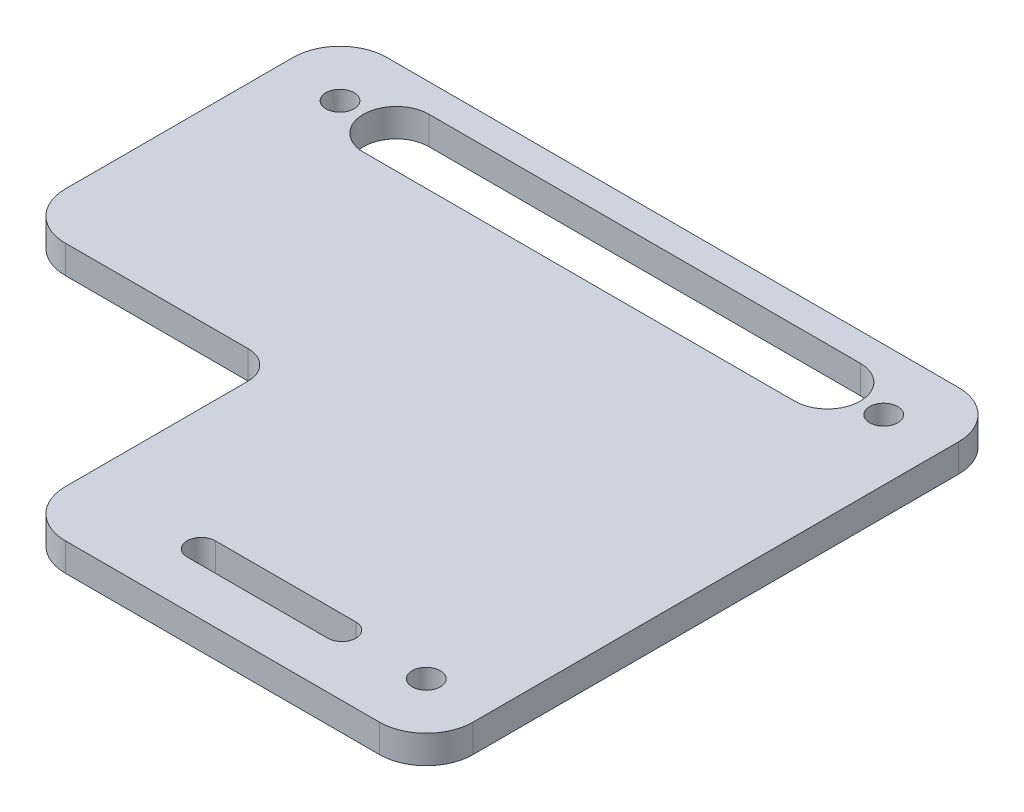
ISO-10303-21;
HEADER;
FILE_DESCRIPTION(('STEP AP214'),'2;1');
FILE_NAME('part.step','',(''),(''),'','','');
FILE_SCHEMA(('AUTOMOTIVE_DESIGN { 1 0 10303 214 1 1 1 1 }'));
ENDSEC;
DATA;
#1=APPLICATION_CONTEXT('core data for automotive mechanical design processes');
#2=APPLICATION_PROTOCOL_DEFINITION('international standard','automotive_design',2000,#1);
#3=PRODUCT_CONTEXT('',#1,'mechanical');
#4=PRODUCT('Part','Part','',(#3));
#5=PRODUCT_RELATED_PRODUCT_CATEGORY('part','',(#4));
#6=PRODUCT_DEFINITION_FORMATION('','',#4);
#7=PRODUCT_DEFINITION_CONTEXT('part definition',#1,'design');
#8=PRODUCT_DEFINITION('design','',#6,#7);
#9=PRODUCT_DEFINITION_SHAPE('','',#8);
#10=(LENGTH_UNIT() NAMED_UNIT(*) SI_UNIT(.MILLI.,.METRE.));
#11=(NAMED_UNIT(*) PLANE_ANGLE_UNIT() SI_UNIT($,.RADIAN.));
#12=(NAMED_UNIT(*) SI_UNIT($,.STERADIAN.) SOLID_ANGLE_UNIT());
#13=UNCERTAINTY_MEASURE_WITH_UNIT(LENGTH_MEASURE(1.E-05),#10,'distance_accuracy_value','');
#14=(GEOMETRIC_REPRESENTATION_CONTEXT(3) GLOBAL_UNCERTAINTY_ASSIGNED_CONTEXT((#13)) GLOBAL_UNIT_ASSIGNED_CONTEXT((#10,
#11,#12)) REPRESENTATION_CONTEXT('',''));
#15=CARTESIAN_POINT('',(0.,0.,0.));
#16=DIRECTION('',(0.,0.,1.));
#17=DIRECTION('',(1.,0.,0.));
#18=AXIS2_PLACEMENT_3D('',#15,#16,#17);
#19=CARTESIAN_POINT('',(-36.9074889867841,3.,40.0621145374449));
#20=DIRECTION('',(1.,0.,0.));
#21=DIRECTION('',(0.,0.,-1.));
#22=AXIS2_PLACEMENT_3D('',#19,#20,#21);
#23=PLANE('',#22);
#24=DIRECTION('',(0.,0.,1.));
#25=VECTOR('',#24,1.);
#26=CARTESIAN_POINT('',(-36.9074889867841,0.,40.0621145374449));
#27=LINE('',#26,#25);
#28=CARTESIAN_POINT('',(-36.9074889867841,0.,-16.7378854625551));
#29=VERTEX_POINT('',#28);
#30=CARTESIAN_POINT('',(-36.9074889867841,0.,7.56211453744492));
#31=VERTEX_POINT('',#30);
#32=EDGE_CURVE('E262',#29,#31,#27,.T.);
#33=ORIENTED_EDGE('',*,*,#32,.T.);
#34=DIRECTION('',(0.,-1.,0.));
#35=VECTOR('',#34,1.);
#36=CARTESIAN_POINT('',(-36.9074889867841,3.,7.56211453744492));
#37=LINE('',#36,#35);
#38=CARTESIAN_POINT('',(-36.9074889867841,3.,7.56211453744492));
#39=VERTEX_POINT('',#38);
#40=EDGE_CURVE('E323',#31,#39,#37,.F.);
#41=ORIENTED_EDGE('',*,*,#40,.T.);
#42=DIRECTION('',(0.,0.,1.));
#43=VECTOR('',#42,1.);
#44=CARTESIAN_POINT('',(-36.9074889867841,3.,40.0621145374449));
#45=LINE('',#44,#43);
#46=CARTESIAN_POINT('',(-36.9074889867841,3.,-16.7378854625551));
#47=VERTEX_POINT('',#46);
#48=EDGE_CURVE('E265',#47,#39,#45,.T.);
#49=ORIENTED_EDGE('',*,*,#48,.F.);
#50=DIRECTION('',(0.,-1.,0.));
#51=VECTOR('',#50,1.);
#52=CARTESIAN_POINT('',(-36.9074889867841,3.,-16.7378854625551));
#53=LINE('',#52,#51);
#54=EDGE_CURVE('E276',#47,#29,#53,.T.);
#55=ORIENTED_EDGE('',*,*,#54,.T.);
#56=EDGE_LOOP('',(#33,#41,#49,#55));
#57=FACE_BOUND('',#56,.T.);
#58=ADVANCED_FACE('F32',(#57),#23,.F.);
#59=CARTESIAN_POINT('',(34.0925110132159,3.,40.0621145374449));
#60=DIRECTION('',(0.,0.,-1.));
#61=DIRECTION('',(-1.,0.,0.));
#62=AXIS2_PLACEMENT_3D('',#59,#60,#61);
#63=PLANE('',#62);
#64=DIRECTION('',(1.,0.,0.));
#65=VECTOR('',#64,1.);
#66=CARTESIAN_POINT('',(34.0925110132159,3.,40.0621145374449));
#67=LINE('',#66,#65);
#68=CARTESIAN_POINT('',(-4.40748898678412,3.,40.0621145374449));
#69=VERTEX_POINT('',#68);
#70=CARTESIAN_POINT('',(29.0925110132159,3.,40.0621145374449));
#71=VERTEX_POINT('',#70);
#72=EDGE_CURVE('E268',#69,#71,#67,.T.);
#73=ORIENTED_EDGE('',*,*,#72,.F.);
#74=DIRECTION('',(0.,-1.,0.));
#75=VECTOR('',#74,1.);
#76=CARTESIAN_POINT('',(-4.40748898678412,3.,40.0621145374449));
#77=LINE('',#76,#75);
#78=CARTESIAN_POINT('',(-4.40748898678412,0.,40.0621145374449));
#79=VERTEX_POINT('',#78);
#80=EDGE_CURVE('E329',#69,#79,#77,.T.);
#81=ORIENTED_EDGE('',*,*,#80,.T.);
#82=DIRECTION('',(1.,0.,0.));
#83=VECTOR('',#82,1.);
#84=CARTESIAN_POINT('',(34.0925110132159,0.,40.0621145374449));
#85=LINE('',#84,#83);
#86=CARTESIAN_POINT('',(29.0925110132159,0.,40.0621145374449));
#87=VERTEX_POINT('',#86);
#88=EDGE_CURVE('E279',#79,#87,#85,.T.);
#89=ORIENTED_EDGE('',*,*,#88,.T.);
#90=DIRECTION('',(0.,-1.,0.));
#91=VECTOR('',#90,1.);
#92=CARTESIAN_POINT('',(29.0925110132159,3.,40.0621145374449));
#93=LINE('',#92,#91);
#94=EDGE_CURVE('E301',#87,#71,#93,.F.);
#95=ORIENTED_EDGE('',*,*,#94,.T.);
#96=EDGE_LOOP('',(#73,#81,#89,#95));
#97=FACE_BOUND('',#96,.T.);
#98=ADVANCED_FACE('F363',(#97),#63,.F.);
#99=CARTESIAN_POINT('',(34.0925110132159,3.,-21.7378854625551));
#100=DIRECTION('',(-1.,0.,0.));
#101=DIRECTION('',(0.,0.,1.));
#102=AXIS2_PLACEMENT_3D('',#99,#100,#101);
#103=PLANE('',#102);
#104=DIRECTION('',(0.,0.,-1.));
#105=VECTOR('',#104,1.);
#106=CARTESIAN_POINT('',(34.0925110132159,0.,-21.7378854625551));
#107=LINE('',#106,#105);
#108=CARTESIAN_POINT('',(34.0925110132159,0.,35.0621145374449));
#109=VERTEX_POINT('',#108);
#110=CARTESIAN_POINT('',(34.0925110132159,0.,-16.7378854625551));
#111=VERTEX_POINT('',#110);
#112=EDGE_CURVE('E281',#109,#111,#107,.T.);
#113=ORIENTED_EDGE('',*,*,#112,.T.);
#114=DIRECTION('',(0.,-1.,0.));
#115=VECTOR('',#114,1.);
#116=CARTESIAN_POINT('',(34.0925110132159,3.,-16.7378854625551));
#117=LINE('',#116,#115);
#118=CARTESIAN_POINT('',(34.0925110132159,3.,-16.7378854625551));
#119=VERTEX_POINT('',#118);
#120=EDGE_CURVE('E311',#111,#119,#117,.F.);
#121=ORIENTED_EDGE('',*,*,#120,.T.);
#122=DIRECTION('',(0.,0.,-1.));
#123=VECTOR('',#122,1.);
#124=CARTESIAN_POINT('',(34.0925110132159,3.,-21.7378854625551));
#125=LINE('',#124,#123);
#126=CARTESIAN_POINT('',(34.0925110132159,3.,35.0621145374449));
#127=VERTEX_POINT('',#126);
#128=EDGE_CURVE('E271',#127,#119,#125,.T.);
#129=ORIENTED_EDGE('',*,*,#128,.F.);
#130=DIRECTION('',(0.,-1.,0.));
#131=VECTOR('',#130,1.);
#132=CARTESIAN_POINT('',(34.0925110132159,3.,35.0621145374449));
#133=LINE('',#132,#131);
#134=EDGE_CURVE('E295',#127,#109,#133,.T.);
#135=ORIENTED_EDGE('',*,*,#134,.T.);
#136=EDGE_LOOP('',(#113,#121,#129,#135));
#137=FACE_BOUND('',#136,.T.);
#138=ADVANCED_FACE('F373',(#137),#103,.F.);
#139=CARTESIAN_POINT('',(-36.9074889867841,3.,-21.7378854625551));
#140=DIRECTION('',(0.,0.,1.));
#141=DIRECTION('',(1.,0.,0.));
#142=AXIS2_PLACEMENT_3D('',#139,#140,#141);
#143=PLANE('',#142);
#144=DIRECTION('',(-1.,0.,0.));
#145=VECTOR('',#144,1.);
#146=CARTESIAN_POINT('',(-36.9074889867841,3.,-21.7378854625551));
#147=LINE('',#146,#145);
#148=CARTESIAN_POINT('',(29.0925110132159,3.,-21.7378854625551));
#149=VERTEX_POINT('',#148);
#150=CARTESIAN_POINT('',(-31.9074889867841,3.,-21.7378854625551));
#151=VERTEX_POINT('',#150);
#152=EDGE_CURVE('E274',#149,#151,#147,.T.);
#153=ORIENTED_EDGE('',*,*,#152,.F.);
#154=DIRECTION('',(0.,-1.,0.));
#155=VECTOR('',#154,1.);
#156=CARTESIAN_POINT('',(29.0925110132159,3.,-21.7378854625551));
#157=LINE('',#156,#155);
#158=CARTESIAN_POINT('',(29.0925110132159,0.,-21.7378854625551));
#159=VERTEX_POINT('',#158);
#160=EDGE_CURVE('E306',#149,#159,#157,.T.);
#161=ORIENTED_EDGE('',*,*,#160,.T.);
#162=DIRECTION('',(-1.,0.,0.));
#163=VECTOR('',#162,1.);
#164=CARTESIAN_POINT('',(-36.9074889867841,0.,-21.7378854625551));
#165=LINE('',#164,#163);
#166=CARTESIAN_POINT('',(-31.9074889867841,0.,-21.7378854625551));
#167=VERTEX_POINT('',#166);
#168=EDGE_CURVE('E269',#159,#167,#165,.T.);
#169=ORIENTED_EDGE('',*,*,#168,.T.);
#170=DIRECTION('',(0.,-1.,0.));
#171=VECTOR('',#170,1.);
#172=CARTESIAN_POINT('',(-31.9074889867841,3.,-21.7378854625551));
#173=LINE('',#172,#171);
#174=EDGE_CURVE('E290',#167,#151,#173,.F.);
#175=ORIENTED_EDGE('',*,*,#174,.T.);
#176=EDGE_LOOP('',(#153,#161,#169,#175));
#177=FACE_BOUND('',#176,.T.);
#178=ADVANCED_FACE('F381',(#177),#143,.F.);
#179=CARTESIAN_POINT('',(0.,3.,0.));
#180=DIRECTION('',(0.,-1.,0.));
#181=DIRECTION('',(0.,0.,-1.));
#182=AXIS2_PLACEMENT_3D('',#179,#180,#181);
#183=PLANE('',#182);
#184=DIRECTION('',(-1.,0.,0.));
#185=VECTOR('',#184,1.);
#186=CARTESIAN_POINT('',(3.59251101321588,3.,35.0621145374449));
#187=LINE('',#186,#185);
#188=CARTESIAN_POINT('',(18.5925110132159,3.,35.0621145374449));
#189=VERTEX_POINT('',#188);
#190=CARTESIAN_POINT('',(3.59251101321588,3.,35.0621145374449));
#191=VERTEX_POINT('',#190);
#192=EDGE_CURVE('E176',#189,#191,#187,.T.);
#193=ORIENTED_EDGE('',*,*,#192,.T.);
#194=CARTESIAN_POINT('',(3.59251101321588,3.,33.5621145374449));
#195=DIRECTION('',(0.,-1.,0.));
#196=DIRECTION('',(0.,0.,-1.));
#197=AXIS2_PLACEMENT_3D('',#194,#195,#196);
#198=CIRCLE('',#197,1.49999999999999);
#199=CARTESIAN_POINT('',(3.59251101321588,3.,32.0621145374449));
#200=VERTEX_POINT('',#199);
#201=EDGE_CURVE('E170',#191,#200,#198,.T.);
#202=ORIENTED_EDGE('',*,*,#201,.T.);
#203=DIRECTION('',(1.,0.,0.));
#204=VECTOR('',#203,1.);
#205=CARTESIAN_POINT('',(3.59251101321588,3.,32.0621145374449));
#206=LINE('',#205,#204);
#207=CARTESIAN_POINT('',(18.5925110132159,3.,32.0621145374449));
#208=VERTEX_POINT('',#207);
#209=EDGE_CURVE('E179',#200,#208,#206,.T.);
#210=ORIENTED_EDGE('',*,*,#209,.T.);
#211=CARTESIAN_POINT('',(18.5925110132159,3.,33.5621145374449));
#212=DIRECTION('',(0.,-1.,0.));
#213=DIRECTION('',(0.,0.,-1.));
#214=AXIS2_PLACEMENT_3D('',#211,#212,#213);
#215=CIRCLE('',#214,1.49999999999999);
#216=EDGE_CURVE('E47',#208,#189,#215,.T.);
#217=ORIENTED_EDGE('',*,*,#216,.T.);
#218=EDGE_LOOP('',(#193,#202,#210,#217));
#219=FACE_BOUND('',#218,.T.);
#220=DIRECTION('',(-1.,0.,0.));
#221=VECTOR('',#220,1.);
#222=CARTESIAN_POINT('',(-24.4074889867841,3.,-11.7378854625551));
#223=LINE('',#222,#221);
#224=CARTESIAN_POINT('',(21.5925110132159,3.,-11.7378854625551));
#225=VERTEX_POINT('',#224);
#226=CARTESIAN_POINT('',(-24.4074889867841,3.,-11.7378854625551));
#227=VERTEX_POINT('',#226);
#228=EDGE_CURVE('E225',#225,#227,#223,.T.);
#229=ORIENTED_EDGE('',*,*,#228,.T.);
#230=CARTESIAN_POINT('',(-24.4074889867841,3.,-15.2378854625551));
#231=DIRECTION('',(0.,-1.,0.));
#232=DIRECTION('',(0.,0.,-1.));
#233=AXIS2_PLACEMENT_3D('',#230,#231,#232);
#234=CIRCLE('',#233,3.49999999999998);
#235=CARTESIAN_POINT('',(-24.4074889867841,3.,-18.7378854625551));
#236=VERTEX_POINT('',#235);
#237=EDGE_CURVE('E215',#227,#236,#234,.T.);
#238=ORIENTED_EDGE('',*,*,#237,.T.);
#239=DIRECTION('',(1.,0.,0.));
#240=VECTOR('',#239,1.);
#241=CARTESIAN_POINT('',(-24.4074889867841,3.,-18.7378854625551));
#242=LINE('',#241,#240);
#243=CARTESIAN_POINT('',(21.5925110132159,3.,-18.737885462555));
#244=VERTEX_POINT('',#243);
#245=EDGE_CURVE('E218',#236,#244,#242,.T.);
#246=ORIENTED_EDGE('',*,*,#245,.T.);
#247=CARTESIAN_POINT('',(21.5925110132159,3.,-15.2378854625551));
#248=DIRECTION('',(0.,-1.,0.));
#249=DIRECTION('',(0.,0.,-1.));
#250=AXIS2_PLACEMENT_3D('',#247,#248,#249);
#251=CIRCLE('',#250,3.49999999999998);
#252=EDGE_CURVE('E222',#244,#225,#251,.T.);
#253=ORIENTED_EDGE('',*,*,#252,.T.);
#254=EDGE_LOOP('',(#229,#238,#246,#253));
#255=FACE_BOUND('',#254,.T.);
#256=CARTESIAN_POINT('',(27.5925110132159,3.,-15.2378854625551));
#257=DIRECTION('',(0.,-1.,0.));
#258=DIRECTION('',(0.,0.,-1.));
#259=AXIS2_PLACEMENT_3D('',#256,#257,#258);
#260=CIRCLE('',#259,1.5);
#261=CARTESIAN_POINT('',(27.5925110132159,3.,-16.7378854625551));
#262=VERTEX_POINT('',#261);
#263=EDGE_CURVE('E247',#262,#262,#260,.T.);
#264=ORIENTED_EDGE('',*,*,#263,.T.);
#265=EDGE_LOOP('',(#264));
#266=FACE_BOUND('',#265,.T.);
#267=CARTESIAN_POINT('',(27.5925110132159,3.,33.5621145374449));
#268=DIRECTION('',(0.,-1.,0.));
#269=DIRECTION('',(0.,0.,-1.));
#270=AXIS2_PLACEMENT_3D('',#267,#268,#269);
#271=CIRCLE('',#270,1.5);
#272=CARTESIAN_POINT('',(27.5925110132159,3.,32.0621145374449));
#273=VERTEX_POINT('',#272);
#274=EDGE_CURVE('E253',#273,#273,#271,.T.);
#275=ORIENTED_EDGE('',*,*,#274,.T.);
#276=EDGE_LOOP('',(#275));
#277=FACE_BOUND('',#276,.T.);
#278=CARTESIAN_POINT('',(-30.4074889867841,3.,-15.2378854625551));
#279=DIRECTION('',(0.,-1.,0.));
#280=DIRECTION('',(0.,0.,-1.));
#281=AXIS2_PLACEMENT_3D('',#278,#279,#280);
#282=CIRCLE('',#281,1.5);
#283=CARTESIAN_POINT('',(-30.4074889867841,3.,-16.7378854625551));
#284=VERTEX_POINT('',#283);
#285=EDGE_CURVE('E259',#284,#284,#282,.T.);
#286=ORIENTED_EDGE('',*,*,#285,.T.);
#287=EDGE_LOOP('',(#286));
#288=FACE_BOUND('',#287,.T.);
#289=ORIENTED_EDGE('',*,*,#48,.T.);
#290=CARTESIAN_POINT('',(-31.9074889867841,3.,7.56211453744492));
#291=DIRECTION('',(0.,-1.,0.));
#292=DIRECTION('',(0.,0.,-1.));
#293=AXIS2_PLACEMENT_3D('',#290,#291,#292);
#294=CIRCLE('',#293,5.);
#295=CARTESIAN_POINT('',(-31.9074889867841,3.,12.5621145374449));
#296=VERTEX_POINT('',#295);
#297=EDGE_CURVE('E327',#39,#296,#294,.F.);
#298=ORIENTED_EDGE('',*,*,#297,.T.);
#299=DIRECTION('',(1.,0.,0.));
#300=VECTOR('',#299,1.);
#301=CARTESIAN_POINT('',(-9.40748898678412,3.,12.5621145374449));
#302=LINE('',#301,#300);
#303=CARTESIAN_POINT('',(-12.4074889867841,3.,12.5621145374449));
#304=VERTEX_POINT('',#303);
#305=EDGE_CURVE('E205',#296,#304,#302,.T.);
#306=ORIENTED_EDGE('',*,*,#305,.T.);
#307=CARTESIAN_POINT('',(-12.4074889867841,3.,15.5621145374449));
#308=DIRECTION('',(0.,-1.,0.));
#309=DIRECTION('',(0.,0.,-1.));
#310=AXIS2_PLACEMENT_3D('',#307,#308,#309);
#311=CIRCLE('',#310,3.);
#312=CARTESIAN_POINT('',(-9.40748898678412,3.,15.5621145374449));
#313=VERTEX_POINT('',#312);
#314=EDGE_CURVE('E11',#304,#313,#311,.T.);
#315=ORIENTED_EDGE('',*,*,#314,.T.);
#316=DIRECTION('',(0.,0.,1.));
#317=VECTOR('',#316,1.);
#318=CARTESIAN_POINT('',(-9.40748898678412,3.,40.0621145374449));
#319=LINE('',#318,#317);
#320=CARTESIAN_POINT('',(-9.40748898678412,3.,35.0621145374449));
#321=VERTEX_POINT('',#320);
#322=EDGE_CURVE('E208',#313,#321,#319,.T.);
#323=ORIENTED_EDGE('',*,*,#322,.T.);
#324=CARTESIAN_POINT('',(-4.40748898678412,3.,35.0621145374449));
#325=DIRECTION('',(0.,-1.,0.));
#326=DIRECTION('',(0.,0.,-1.));
#327=AXIS2_PLACEMENT_3D('',#324,#325,#326);
#328=CIRCLE('',#327,5.);
#329=EDGE_CURVE('E325',#321,#69,#328,.F.);
#330=ORIENTED_EDGE('',*,*,#329,.T.);
#331=ORIENTED_EDGE('',*,*,#72,.T.);
#332=CARTESIAN_POINT('',(29.0925110132159,3.,35.0621145374449));
#333=DIRECTION('',(0.,-1.,0.));
#334=DIRECTION('',(0.,0.,-1.));
#335=AXIS2_PLACEMENT_3D('',#332,#333,#334);
#336=CIRCLE('',#335,5.);
#337=EDGE_CURVE('E304',#71,#127,#336,.F.);
#338=ORIENTED_EDGE('',*,*,#337,.T.);
#339=ORIENTED_EDGE('',*,*,#128,.T.);
#340=CARTESIAN_POINT('',(29.0925110132159,3.,-16.7378854625551));
#341=DIRECTION('',(0.,-1.,0.));
#342=DIRECTION('',(0.,0.,-1.));
#343=AXIS2_PLACEMENT_3D('',#340,#341,#342);
#344=CIRCLE('',#343,5.);
#345=EDGE_CURVE('E313',#119,#149,#344,.F.);
#346=ORIENTED_EDGE('',*,*,#345,.T.);
#347=ORIENTED_EDGE('',*,*,#152,.T.);
#348=CARTESIAN_POINT('',(-31.9074889867841,3.,-16.7378854625551));
#349=DIRECTION('',(0.,-1.,0.));
#350=DIRECTION('',(0.,0.,-1.));
#351=AXIS2_PLACEMENT_3D('',#348,#349,#350);
#352=CIRCLE('',#351,5.);
#353=EDGE_CURVE('E293',#151,#47,#352,.F.);
#354=ORIENTED_EDGE('',*,*,#353,.T.);
#355=EDGE_LOOP('',(#289,#298,#306,#315,#323,#330,#331,#338,#339,#346,#347,#354));
#356=FACE_BOUND('',#355,.T.);
#357=ADVANCED_FACE('F183',(#219,#255,#266,#277,#288,#356),#183,.F.);
#358=CARTESIAN_POINT('',(0.,0.,0.));
#359=DIRECTION('',(0.,-1.,0.));
#360=DIRECTION('',(0.,0.,-1.));
#361=AXIS2_PLACEMENT_3D('',#358,#359,#360);
#362=PLANE('',#361);
#363=CARTESIAN_POINT('',(3.59251101321588,0.,33.5621145374449));
#364=DIRECTION('',(0.,-1.,0.));
#365=DIRECTION('',(0.,0.,-1.));
#366=AXIS2_PLACEMENT_3D('',#363,#364,#365);
#367=CIRCLE('',#366,1.49999999999999);
#368=CARTESIAN_POINT('',(3.59251101321588,0.,35.0621145374449));
#369=VERTEX_POINT('',#368);
#370=CARTESIAN_POINT('',(3.59251101321588,0.,32.0621145374449));
#371=VERTEX_POINT('',#370);
#372=EDGE_CURVE('E55',#369,#371,#367,.T.);
#373=ORIENTED_EDGE('',*,*,#372,.F.);
#374=DIRECTION('',(-1.,0.,0.));
#375=VECTOR('',#374,1.);
#376=CARTESIAN_POINT('',(3.59251101321588,0.,35.0621145374449));
#377=LINE('',#376,#375);
#378=CARTESIAN_POINT('',(18.5925110132159,0.,35.0621145374449));
#379=VERTEX_POINT('',#378);
#380=EDGE_CURVE('E186',#379,#369,#377,.T.);
#381=ORIENTED_EDGE('',*,*,#380,.F.);
#382=CARTESIAN_POINT('',(18.5925110132159,0.,33.5621145374449));
#383=DIRECTION('',(0.,-1.,0.));
#384=DIRECTION('',(0.,0.,-1.));
#385=AXIS2_PLACEMENT_3D('',#382,#383,#384);
#386=CIRCLE('',#385,1.49999999999999);
#387=CARTESIAN_POINT('',(18.5925110132159,0.,32.0621145374449));
#388=VERTEX_POINT('',#387);
#389=EDGE_CURVE('E189',#388,#379,#386,.T.);
#390=ORIENTED_EDGE('',*,*,#389,.F.);
#391=DIRECTION('',(1.,0.,0.));
#392=VECTOR('',#391,1.);
#393=CARTESIAN_POINT('',(3.59251101321588,0.,32.0621145374449));
#394=LINE('',#393,#392);
#395=EDGE_CURVE('E195',#371,#388,#394,.T.);
#396=ORIENTED_EDGE('',*,*,#395,.F.);
#397=EDGE_LOOP('',(#373,#381,#390,#396));
#398=FACE_BOUND('',#397,.T.);
#399=DIRECTION('',(1.,0.,0.));
#400=VECTOR('',#399,1.);
#401=CARTESIAN_POINT('',(-9.40748898678412,0.,12.5621145374449));
#402=LINE('',#401,#400);
#403=CARTESIAN_POINT('',(-31.9074889867841,0.,12.5621145374449));
#404=VERTEX_POINT('',#403);
#405=CARTESIAN_POINT('',(-12.4074889867841,0.,12.5621145374449));
#406=VERTEX_POINT('',#405);
#407=EDGE_CURVE('E201',#404,#406,#402,.T.);
#408=ORIENTED_EDGE('',*,*,#407,.F.);
#409=CARTESIAN_POINT('',(-31.9074889867841,0.,7.56211453744492));
#410=DIRECTION('',(0.,-1.,0.));
#411=DIRECTION('',(0.,0.,-1.));
#412=AXIS2_PLACEMENT_3D('',#409,#410,#411);
#413=CIRCLE('',#412,5.);
#414=EDGE_CURVE('E321',#404,#31,#413,.T.);
#415=ORIENTED_EDGE('',*,*,#414,.T.);
#416=ORIENTED_EDGE('',*,*,#32,.F.);
#417=CARTESIAN_POINT('',(-31.9074889867841,0.,-16.7378854625551));
#418=DIRECTION('',(0.,-1.,0.));
#419=DIRECTION('',(0.,0.,-1.));
#420=AXIS2_PLACEMENT_3D('',#417,#418,#419);
#421=CIRCLE('',#420,5.);
#422=EDGE_CURVE('E287',#29,#167,#421,.T.);
#423=ORIENTED_EDGE('',*,*,#422,.T.);
#424=ORIENTED_EDGE('',*,*,#168,.F.);
#425=CARTESIAN_POINT('',(29.0925110132159,0.,-16.7378854625551));
#426=DIRECTION('',(0.,-1.,0.));
#427=DIRECTION('',(0.,0.,-1.));
#428=AXIS2_PLACEMENT_3D('',#425,#426,#427);
#429=CIRCLE('',#428,5.);
#430=EDGE_CURVE('E309',#159,#111,#429,.T.);
#431=ORIENTED_EDGE('',*,*,#430,.T.);
#432=ORIENTED_EDGE('',*,*,#112,.F.);
#433=CARTESIAN_POINT('',(29.0925110132159,0.,35.0621145374449));
#434=DIRECTION('',(0.,-1.,0.));
#435=DIRECTION('',(0.,0.,-1.));
#436=AXIS2_PLACEMENT_3D('',#433,#434,#435);
#437=CIRCLE('',#436,5.);
#438=EDGE_CURVE('E298',#109,#87,#437,.T.);
#439=ORIENTED_EDGE('',*,*,#438,.T.);
#440=ORIENTED_EDGE('',*,*,#88,.F.);
#441=CARTESIAN_POINT('',(-4.40748898678412,0.,35.0621145374449));
#442=DIRECTION('',(0.,-1.,0.));
#443=DIRECTION('',(0.,0.,-1.));
#444=AXIS2_PLACEMENT_3D('',#441,#442,#443);
#445=CIRCLE('',#444,5.);
#446=CARTESIAN_POINT('',(-9.40748898678412,0.,35.0621145374449));
#447=VERTEX_POINT('',#446);
#448=EDGE_CURVE('E318',#79,#447,#445,.T.);
#449=ORIENTED_EDGE('',*,*,#448,.T.);
#450=DIRECTION('',(0.,0.,1.));
#451=VECTOR('',#450,1.);
#452=CARTESIAN_POINT('',(-9.40748898678412,0.,40.0621145374449));
#453=LINE('',#452,#451);
#454=CARTESIAN_POINT('',(-9.40748898678412,0.,15.5621145374449));
#455=VERTEX_POINT('',#454);
#456=EDGE_CURVE('E209',#455,#447,#453,.T.);
#457=ORIENTED_EDGE('',*,*,#456,.F.);
#458=CARTESIAN_POINT('',(-12.4074889867841,0.,15.5621145374449));
#459=DIRECTION('',(0.,-1.,0.));
#460=DIRECTION('',(0.,0.,-1.));
#461=AXIS2_PLACEMENT_3D('',#458,#459,#460);
#462=CIRCLE('',#461,3.);
#463=EDGE_CURVE('E40',#455,#406,#462,.F.);
#464=ORIENTED_EDGE('',*,*,#463,.T.);
#465=EDGE_LOOP('',(#408,#415,#416,#423,#424,#431,#432,#439,#440,#449,#457,#464));
#466=FACE_BOUND('',#465,.T.);
#467=CARTESIAN_POINT('',(-24.4074889867841,0.,-15.2378854625551));
#468=DIRECTION('',(0.,-1.,0.));
#469=DIRECTION('',(0.,0.,-1.));
#470=AXIS2_PLACEMENT_3D('',#467,#468,#469);
#471=CIRCLE('',#470,3.49999999999998);
#472=CARTESIAN_POINT('',(-24.4074889867841,0.,-11.7378854625551));
#473=VERTEX_POINT('',#472);
#474=CARTESIAN_POINT('',(-24.4074889867841,0.,-18.7378854625551));
#475=VERTEX_POINT('',#474);
#476=EDGE_CURVE('E211',#473,#475,#471,.T.);
#477=ORIENTED_EDGE('',*,*,#476,.F.);
#478=DIRECTION('',(-1.,0.,0.));
#479=VECTOR('',#478,1.);
#480=CARTESIAN_POINT('',(-24.4074889867841,0.,-11.7378854625551));
#481=LINE('',#480,#479);
#482=CARTESIAN_POINT('',(21.5925110132159,0.,-11.7378854625551));
#483=VERTEX_POINT('',#482);
#484=EDGE_CURVE('E219',#483,#473,#481,.T.);
#485=ORIENTED_EDGE('',*,*,#484,.F.);
#486=CARTESIAN_POINT('',(21.5925110132159,0.,-15.2378854625551));
#487=DIRECTION('',(0.,-1.,0.));
#488=DIRECTION('',(0.,0.,-1.));
#489=AXIS2_PLACEMENT_3D('',#486,#487,#488);
#490=CIRCLE('',#489,3.49999999999998);
#491=CARTESIAN_POINT('',(21.5925110132159,0.,-18.7378854625551));
#492=VERTEX_POINT('',#491);
#493=EDGE_CURVE('E233',#492,#483,#490,.T.);
#494=ORIENTED_EDGE('',*,*,#493,.F.);
#495=DIRECTION('',(1.,0.,0.));
#496=VECTOR('',#495,1.);
#497=CARTESIAN_POINT('',(-24.4074889867841,0.,-18.7378854625551));
#498=LINE('',#497,#496);
#499=EDGE_CURVE('E230',#475,#492,#498,.T.);
#500=ORIENTED_EDGE('',*,*,#499,.F.);
#501=EDGE_LOOP('',(#477,#485,#494,#500));
#502=FACE_BOUND('',#501,.T.);
#503=CARTESIAN_POINT('',(27.5925110132159,0.,-15.2378854625551));
#504=DIRECTION('',(0.,-1.,0.));
#505=DIRECTION('',(0.,0.,-1.));
#506=AXIS2_PLACEMENT_3D('',#503,#504,#505);
#507=CIRCLE('',#506,1.5);
#508=CARTESIAN_POINT('',(27.5925110132159,0.,-16.7378854625551));
#509=VERTEX_POINT('',#508);
#510=EDGE_CURVE('E240',#509,#509,#507,.T.);
#511=ORIENTED_EDGE('',*,*,#510,.F.);
#512=EDGE_LOOP('',(#511));
#513=FACE_BOUND('',#512,.T.);
#514=CARTESIAN_POINT('',(27.5925110132159,0.,33.5621145374449));
#515=DIRECTION('',(0.,-1.,0.));
#516=DIRECTION('',(0.,0.,-1.));
#517=AXIS2_PLACEMENT_3D('',#514,#515,#516);
#518=CIRCLE('',#517,1.5);
#519=CARTESIAN_POINT('',(27.5925110132159,0.,32.0621145374449));
#520=VERTEX_POINT('',#519);
#521=EDGE_CURVE('E250',#520,#520,#518,.T.);
#522=ORIENTED_EDGE('',*,*,#521,.F.);
#523=EDGE_LOOP('',(#522));
#524=FACE_BOUND('',#523,.T.);
#525=CARTESIAN_POINT('',(-30.4074889867841,0.,-15.2378854625551));
#526=DIRECTION('',(0.,-1.,0.));
#527=DIRECTION('',(0.,0.,-1.));
#528=AXIS2_PLACEMENT_3D('',#525,#526,#527);
#529=CIRCLE('',#528,1.5);
#530=CARTESIAN_POINT('',(-30.4074889867841,0.,-16.7378854625551));
#531=VERTEX_POINT('',#530);
#532=EDGE_CURVE('E256',#531,#531,#529,.T.);
#533=ORIENTED_EDGE('',*,*,#532,.F.);
#534=EDGE_LOOP('',(#533));
#535=FACE_BOUND('',#534,.T.);
#536=ADVANCED_FACE('F342',(#398,#466,#502,#513,#524,#535),#362,.T.);
#537=CARTESIAN_POINT('',(-31.9074889867841,3.,-16.7378854625551));
#538=DIRECTION('',(0.,-1.,0.));
#539=DIRECTION('',(0.,0.,-1.));
#540=AXIS2_PLACEMENT_3D('',#537,#538,#539);
#541=CYLINDRICAL_SURFACE('',#540,5.);
#542=ORIENTED_EDGE('',*,*,#353,.F.);
#543=ORIENTED_EDGE('',*,*,#174,.F.);
#544=ORIENTED_EDGE('',*,*,#422,.F.);
#545=ORIENTED_EDGE('',*,*,#54,.F.);
#546=EDGE_LOOP('',(#542,#543,#544,#545));
#547=FACE_BOUND('',#546,.T.);
#548=ADVANCED_FACE('F387',(#547),#541,.T.);
#549=CARTESIAN_POINT('',(29.0925110132159,3.,35.0621145374449));
#550=DIRECTION('',(0.,-1.,0.));
#551=DIRECTION('',(0.,0.,-1.));
#552=AXIS2_PLACEMENT_3D('',#549,#550,#551);
#553=CYLINDRICAL_SURFACE('',#552,5.);
#554=ORIENTED_EDGE('',*,*,#337,.F.);
#555=ORIENTED_EDGE('',*,*,#94,.F.);
#556=ORIENTED_EDGE('',*,*,#438,.F.);
#557=ORIENTED_EDGE('',*,*,#134,.F.);
#558=EDGE_LOOP('',(#554,#555,#556,#557));
#559=FACE_BOUND('',#558,.T.);
#560=ADVANCED_FACE('F369',(#559),#553,.T.);
#561=CARTESIAN_POINT('',(29.0925110132159,3.,-16.7378854625551));
#562=DIRECTION('',(0.,-1.,0.));
#563=DIRECTION('',(0.,0.,-1.));
#564=AXIS2_PLACEMENT_3D('',#561,#562,#563);
#565=CYLINDRICAL_SURFACE('',#564,5.);
#566=ORIENTED_EDGE('',*,*,#345,.F.);
#567=ORIENTED_EDGE('',*,*,#120,.F.);
#568=ORIENTED_EDGE('',*,*,#430,.F.);
#569=ORIENTED_EDGE('',*,*,#160,.F.);
#570=EDGE_LOOP('',(#566,#567,#568,#569));
#571=FACE_BOUND('',#570,.T.);
#572=ADVANCED_FACE('F377',(#571),#565,.T.);
#573=CARTESIAN_POINT('',(-30.4074889867841,3.,-15.2378854625551));
#574=DIRECTION('',(0.,-1.,0.));
#575=DIRECTION('',(0.,0.,-1.));
#576=AXIS2_PLACEMENT_3D('',#573,#574,#575);
#577=CYLINDRICAL_SURFACE('',#576,1.5);
#578=ORIENTED_EDGE('',*,*,#285,.F.);
#579=EDGE_LOOP('',(#578));
#580=FACE_BOUND('',#579,.T.);
#581=ORIENTED_EDGE('',*,*,#532,.T.);
#582=EDGE_LOOP('',(#581));
#583=FACE_BOUND('',#582,.T.);
#584=ADVANCED_FACE('F415',(#580,#583),#577,.F.);
#585=CARTESIAN_POINT('',(27.5925110132159,3.,33.5621145374449));
#586=DIRECTION('',(0.,-1.,0.));
#587=DIRECTION('',(0.,0.,-1.));
#588=AXIS2_PLACEMENT_3D('',#585,#586,#587);
#589=CYLINDRICAL_SURFACE('',#588,1.5);
#590=ORIENTED_EDGE('',*,*,#274,.F.);
#591=EDGE_LOOP('',(#590));
#592=FACE_BOUND('',#591,.T.);
#593=ORIENTED_EDGE('',*,*,#521,.T.);
#594=EDGE_LOOP('',(#593));
#595=FACE_BOUND('',#594,.T.);
#596=ADVANCED_FACE('F419',(#592,#595),#589,.F.);
#597=CARTESIAN_POINT('',(27.5925110132159,3.,-15.2378854625551));
#598=DIRECTION('',(0.,-1.,0.));
#599=DIRECTION('',(0.,0.,-1.));
#600=AXIS2_PLACEMENT_3D('',#597,#598,#599);
#601=CYLINDRICAL_SURFACE('',#600,1.5);
#602=ORIENTED_EDGE('',*,*,#263,.F.);
#603=EDGE_LOOP('',(#602));
#604=FACE_BOUND('',#603,.T.);
#605=ORIENTED_EDGE('',*,*,#510,.T.);
#606=EDGE_LOOP('',(#605));
#607=FACE_BOUND('',#606,.T.);
#608=ADVANCED_FACE('F425',(#604,#607),#601,.F.);
#609=CARTESIAN_POINT('',(-24.4074889867841,3.,-15.2378854625551));
#610=DIRECTION('',(0.,-1.,0.));
#611=DIRECTION('',(0.,0.,-1.));
#612=AXIS2_PLACEMENT_3D('',#609,#610,#611);
#613=CYLINDRICAL_SURFACE('',#612,3.49999999999998);
#614=ORIENTED_EDGE('',*,*,#476,.T.);
#615=DIRECTION('',(0.,-1.,0.));
#616=VECTOR('',#615,1.);
#617=CARTESIAN_POINT('',(-24.4074889867841,3.,-18.7378854625551));
#618=LINE('',#617,#616);
#619=EDGE_CURVE('E228',#236,#475,#618,.T.);
#620=ORIENTED_EDGE('',*,*,#619,.F.);
#621=ORIENTED_EDGE('',*,*,#237,.F.);
#622=DIRECTION('',(0.,-1.,0.));
#623=VECTOR('',#622,1.);
#624=CARTESIAN_POINT('',(-24.4074889867841,3.,-11.7378854625551));
#625=LINE('',#624,#623);
#626=EDGE_CURVE('E238',#227,#473,#625,.T.);
#627=ORIENTED_EDGE('',*,*,#626,.T.);
#628=EDGE_LOOP('',(#614,#620,#621,#627));
#629=FACE_BOUND('',#628,.T.);
#630=ADVANCED_FACE('F490',(#629),#613,.F.);
#631=CARTESIAN_POINT('',(-24.4074889867841,3.,-11.7378854625551));
#632=DIRECTION('',(0.,0.,1.));
#633=DIRECTION('',(1.,0.,0.));
#634=AXIS2_PLACEMENT_3D('',#631,#632,#633);
#635=PLANE('',#634);
#636=ORIENTED_EDGE('',*,*,#484,.T.);
#637=ORIENTED_EDGE('',*,*,#626,.F.);
#638=ORIENTED_EDGE('',*,*,#228,.F.);
#639=DIRECTION('',(0.,-1.,0.));
#640=VECTOR('',#639,1.);
#641=CARTESIAN_POINT('',(21.5925110132159,3.,-11.7378854625551));
#642=LINE('',#641,#640);
#643=EDGE_CURVE('E241',#225,#483,#642,.T.);
#644=ORIENTED_EDGE('',*,*,#643,.T.);
#645=EDGE_LOOP('',(#636,#637,#638,#644));
#646=FACE_BOUND('',#645,.T.);
#647=ADVANCED_FACE('F498',(#646),#635,.F.);
#648=CARTESIAN_POINT('',(21.5925110132159,3.,-15.2378854625551));
#649=DIRECTION('',(0.,-1.,0.));
#650=DIRECTION('',(0.,0.,-1.));
#651=AXIS2_PLACEMENT_3D('',#648,#649,#650);
#652=CYLINDRICAL_SURFACE('',#651,3.49999999999998);
#653=ORIENTED_EDGE('',*,*,#493,.T.);
#654=ORIENTED_EDGE('',*,*,#643,.F.);
#655=ORIENTED_EDGE('',*,*,#252,.F.);
#656=DIRECTION('',(0.,-1.,0.));
#657=VECTOR('',#656,1.);
#658=CARTESIAN_POINT('',(21.5925110132159,3.,-18.7378854625551));
#659=LINE('',#658,#657);
#660=EDGE_CURVE('E243',#244,#492,#659,.T.);
#661=ORIENTED_EDGE('',*,*,#660,.T.);
#662=EDGE_LOOP('',(#653,#654,#655,#661));
#663=FACE_BOUND('',#662,.T.);
#664=ADVANCED_FACE('F507',(#663),#652,.F.);
#665=CARTESIAN_POINT('',(-24.4074889867841,3.,-18.7378854625551));
#666=DIRECTION('',(0.,0.,-1.));
#667=DIRECTION('',(-1.,0.,0.));
#668=AXIS2_PLACEMENT_3D('',#665,#666,#667);
#669=PLANE('',#668);
#670=ORIENTED_EDGE('',*,*,#499,.T.);
#671=ORIENTED_EDGE('',*,*,#660,.F.);
#672=ORIENTED_EDGE('',*,*,#245,.F.);
#673=ORIENTED_EDGE('',*,*,#619,.T.);
#674=EDGE_LOOP('',(#670,#671,#672,#673));
#675=FACE_BOUND('',#674,.T.);
#676=ADVANCED_FACE('F516',(#675),#669,.F.);
#677=CARTESIAN_POINT('',(-9.40748898678412,3.,40.0621145374449));
#678=DIRECTION('',(1.,0.,0.));
#679=DIRECTION('',(0.,0.,-1.));
#680=AXIS2_PLACEMENT_3D('',#677,#678,#679);
#681=PLANE('',#680);
#682=ORIENTED_EDGE('',*,*,#322,.F.);
#683=DIRECTION('',(0.,-1.,0.));
#684=VECTOR('',#683,1.);
#685=CARTESIAN_POINT('',(-9.40748898678412,0.,15.5621145374449));
#686=LINE('',#685,#684);
#687=EDGE_CURVE('E335',#313,#455,#686,.T.);
#688=ORIENTED_EDGE('',*,*,#687,.T.);
#689=ORIENTED_EDGE('',*,*,#456,.T.);
#690=DIRECTION('',(0.,-1.,0.));
#691=VECTOR('',#690,1.);
#692=CARTESIAN_POINT('',(-9.40748898678412,3.,35.0621145374449));
#693=LINE('',#692,#691);
#694=EDGE_CURVE('E332',#447,#321,#693,.F.);
#695=ORIENTED_EDGE('',*,*,#694,.T.);
#696=EDGE_LOOP('',(#682,#688,#689,#695));
#697=FACE_BOUND('',#696,.T.);
#698=ADVANCED_FACE('F355',(#697),#681,.F.);
#699=CARTESIAN_POINT('',(-9.40748898678412,3.,12.5621145374449));
#700=DIRECTION('',(0.,0.,-1.));
#701=DIRECTION('',(-1.,0.,0.));
#702=AXIS2_PLACEMENT_3D('',#699,#700,#701);
#703=PLANE('',#702);
#704=ORIENTED_EDGE('',*,*,#407,.T.);
#705=DIRECTION('',(0.,-1.,0.));
#706=VECTOR('',#705,1.);
#707=CARTESIAN_POINT('',(-12.4074889867841,3.,12.5621145374449));
#708=LINE('',#707,#706);
#709=EDGE_CURVE('E338',#406,#304,#708,.F.);
#710=ORIENTED_EDGE('',*,*,#709,.T.);
#711=ORIENTED_EDGE('',*,*,#305,.F.);
#712=DIRECTION('',(0.,-1.,0.));
#713=VECTOR('',#712,1.);
#714=CARTESIAN_POINT('',(-31.9074889867841,3.,12.5621145374449));
#715=LINE('',#714,#713);
#716=EDGE_CURVE('E315',#296,#404,#715,.T.);
#717=ORIENTED_EDGE('',*,*,#716,.T.);
#718=EDGE_LOOP('',(#704,#710,#711,#717));
#719=FACE_BOUND('',#718,.T.);
#720=ADVANCED_FACE('F348',(#719),#703,.F.);
#721=CARTESIAN_POINT('',(-31.9074889867841,3.,7.56211453744492));
#722=DIRECTION('',(0.,-1.,0.));
#723=DIRECTION('',(0.,0.,-1.));
#724=AXIS2_PLACEMENT_3D('',#721,#722,#723);
#725=CYLINDRICAL_SURFACE('',#724,5.);
#726=ORIENTED_EDGE('',*,*,#297,.F.);
#727=ORIENTED_EDGE('',*,*,#40,.F.);
#728=ORIENTED_EDGE('',*,*,#414,.F.);
#729=ORIENTED_EDGE('',*,*,#716,.F.);
#730=EDGE_LOOP('',(#726,#727,#728,#729));
#731=FACE_BOUND('',#730,.T.);
#732=ADVANCED_FACE('F394',(#731),#725,.T.);
#733=CARTESIAN_POINT('',(-4.40748898678412,3.,35.0621145374449));
#734=DIRECTION('',(0.,-1.,0.));
#735=DIRECTION('',(0.,0.,-1.));
#736=AXIS2_PLACEMENT_3D('',#733,#734,#735);
#737=CYLINDRICAL_SURFACE('',#736,5.);
#738=ORIENTED_EDGE('',*,*,#329,.F.);
#739=ORIENTED_EDGE('',*,*,#694,.F.);
#740=ORIENTED_EDGE('',*,*,#448,.F.);
#741=ORIENTED_EDGE('',*,*,#80,.F.);
#742=EDGE_LOOP('',(#738,#739,#740,#741));
#743=FACE_BOUND('',#742,.T.);
#744=ADVANCED_FACE('F360',(#743),#737,.T.);
#745=CARTESIAN_POINT('',(-12.4074889867841,3.,15.5621145374449));
#746=DIRECTION('',(0.,1.,0.));
#747=DIRECTION('',(0.,0.,1.));
#748=AXIS2_PLACEMENT_3D('',#745,#746,#747);
#749=CYLINDRICAL_SURFACE('',#748,3.);
#750=ORIENTED_EDGE('',*,*,#314,.F.);
#751=ORIENTED_EDGE('',*,*,#709,.F.);
#752=ORIENTED_EDGE('',*,*,#463,.F.);
#753=ORIENTED_EDGE('',*,*,#687,.F.);
#754=EDGE_LOOP('',(#750,#751,#752,#753));
#755=FACE_BOUND('',#754,.T.);
#756=ADVANCED_FACE('F34',(#755),#749,.F.);
#757=CARTESIAN_POINT('',(3.59251101321588,3.,33.5621145374449));
#758=DIRECTION('',(0.,-1.,0.));
#759=DIRECTION('',(0.,0.,-1.));
#760=AXIS2_PLACEMENT_3D('',#757,#758,#759);
#761=CYLINDRICAL_SURFACE('',#760,1.49999999999999);
#762=ORIENTED_EDGE('',*,*,#372,.T.);
#763=DIRECTION('',(0.,-1.,0.));
#764=VECTOR('',#763,1.);
#765=CARTESIAN_POINT('',(3.59251101321588,3.,32.0621145374449));
#766=LINE('',#765,#764);
#767=EDGE_CURVE('E166',#200,#371,#766,.T.);
#768=ORIENTED_EDGE('',*,*,#767,.F.);
#769=ORIENTED_EDGE('',*,*,#201,.F.);
#770=DIRECTION('',(0.,-1.,0.));
#771=VECTOR('',#770,1.);
#772=CARTESIAN_POINT('',(3.59251101321588,3.,35.0621145374449));
#773=LINE('',#772,#771);
#774=EDGE_CURVE('E199',#191,#369,#773,.T.);
#775=ORIENTED_EDGE('',*,*,#774,.T.);
#776=EDGE_LOOP('',(#762,#768,#769,#775));
#777=FACE_BOUND('',#776,.T.);
#778=ADVANCED_FACE('F168',(#777),#761,.F.);
#779=CARTESIAN_POINT('',(3.59251101321588,3.,35.0621145374449));
#780=DIRECTION('',(0.,0.,1.));
#781=DIRECTION('',(1.,0.,0.));
#782=AXIS2_PLACEMENT_3D('',#779,#780,#781);
#783=PLANE('',#782);
#784=ORIENTED_EDGE('',*,*,#380,.T.);
#785=ORIENTED_EDGE('',*,*,#774,.F.);
#786=ORIENTED_EDGE('',*,*,#192,.F.);
#787=DIRECTION('',(0.,-1.,0.));
#788=VECTOR('',#787,1.);
#789=CARTESIAN_POINT('',(18.5925110132159,3.,35.0621145374449));
#790=LINE('',#789,#788);
#791=EDGE_CURVE('E202',#189,#379,#790,.T.);
#792=ORIENTED_EDGE('',*,*,#791,.T.);
#793=EDGE_LOOP('',(#784,#785,#786,#792));
#794=FACE_BOUND('',#793,.T.);
#795=ADVANCED_FACE('F558',(#794),#783,.F.);
#796=CARTESIAN_POINT('',(18.5925110132159,3.,33.5621145374449));
#797=DIRECTION('',(0.,-1.,0.));
#798=DIRECTION('',(0.,0.,-1.));
#799=AXIS2_PLACEMENT_3D('',#796,#797,#798);
#800=CYLINDRICAL_SURFACE('',#799,1.49999999999999);
#801=ORIENTED_EDGE('',*,*,#389,.T.);
#802=ORIENTED_EDGE('',*,*,#791,.F.);
#803=ORIENTED_EDGE('',*,*,#216,.F.);
#804=DIRECTION('',(0.,-1.,0.));
#805=VECTOR('',#804,1.);
#806=CARTESIAN_POINT('',(18.5925110132159,3.,32.0621145374449));
#807=LINE('',#806,#805);
#808=EDGE_CURVE('E175',#208,#388,#807,.T.);
#809=ORIENTED_EDGE('',*,*,#808,.T.);
#810=EDGE_LOOP('',(#801,#802,#803,#809));
#811=FACE_BOUND('',#810,.T.);
#812=ADVANCED_FACE('F566',(#811),#800,.F.);
#813=CARTESIAN_POINT('',(3.59251101321588,3.,32.0621145374449));
#814=DIRECTION('',(0.,0.,-1.));
#815=DIRECTION('',(-1.,0.,0.));
#816=AXIS2_PLACEMENT_3D('',#813,#814,#815);
#817=PLANE('',#816);
#818=ORIENTED_EDGE('',*,*,#395,.T.);
#819=ORIENTED_EDGE('',*,*,#808,.F.);
#820=ORIENTED_EDGE('',*,*,#209,.F.);
#821=ORIENTED_EDGE('',*,*,#767,.T.);
#822=EDGE_LOOP('',(#818,#819,#820,#821));
#823=FACE_BOUND('',#822,.T.);
#824=ADVANCED_FACE('F180',(#823),#817,.F.);
#825=CLOSED_SHELL('',(#58,#98,#138,#178,#357,#536,#548,#560,#572,#584,#596,#608,#630,#647,#664,
#676,#698,#720,#732,#744,#756,#778,#795,#812,#824));
#826=MANIFOLD_SOLID_BREP('B2',#825);
#827=ADVANCED_BREP_SHAPE_REPRESENTATION('',(#18,#826),#14);
#828=SHAPE_DEFINITION_REPRESENTATION(#9,#827);
ENDSEC;
END-ISO-10303-21;
